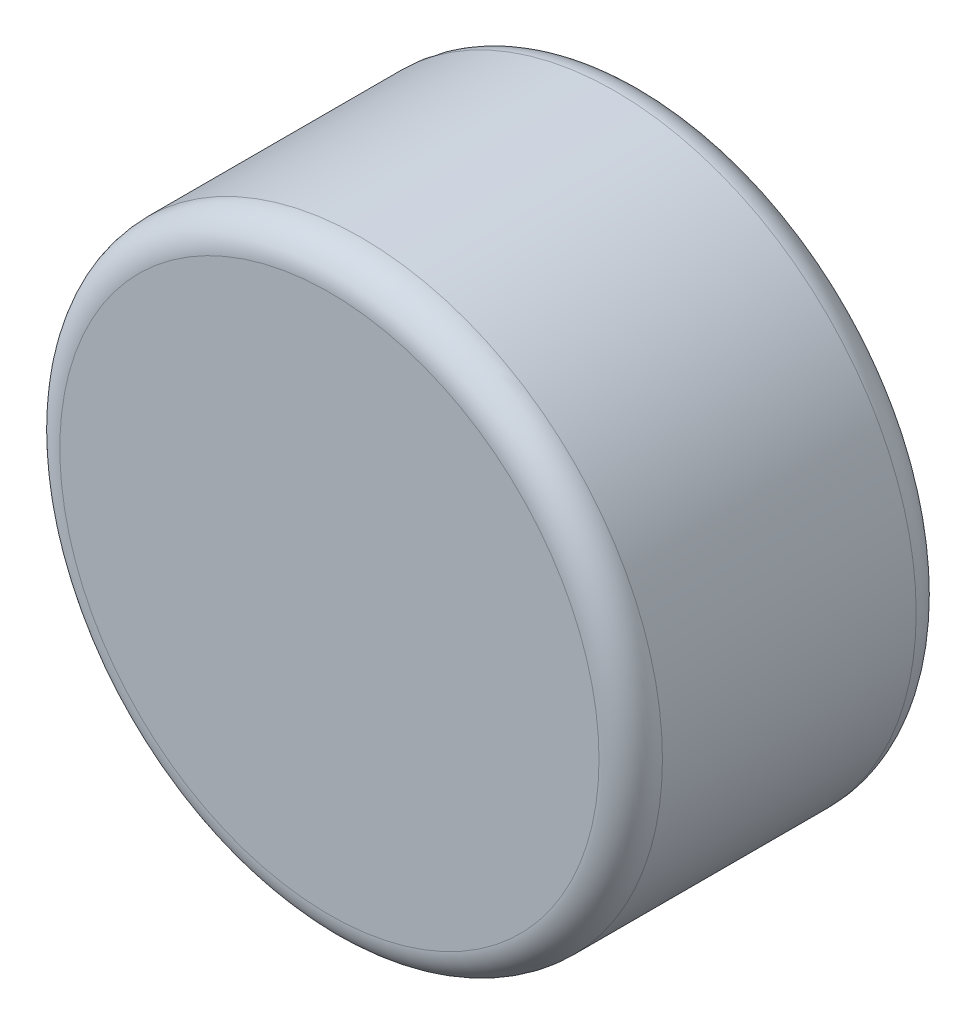
ISO-10303-21;
HEADER;
FILE_DESCRIPTION(('STEP AP214'),'2;1');
FILE_NAME('part.step','',(''),(''),'','','');
FILE_SCHEMA(('AUTOMOTIVE_DESIGN { 1 0 10303 214 1 1 1 1 }'));
ENDSEC;
DATA;
#1=APPLICATION_CONTEXT('core data for automotive mechanical design processes');
#2=APPLICATION_PROTOCOL_DEFINITION('international standard','automotive_design',2000,#1);
#3=PRODUCT_CONTEXT('',#1,'mechanical');
#4=PRODUCT('Part','Part','',(#3));
#5=PRODUCT_RELATED_PRODUCT_CATEGORY('part','',(#4));
#6=PRODUCT_DEFINITION_FORMATION('','',#4);
#7=PRODUCT_DEFINITION_CONTEXT('part definition',#1,'design');
#8=PRODUCT_DEFINITION('design','',#6,#7);
#9=PRODUCT_DEFINITION_SHAPE('','',#8);
#10=(LENGTH_UNIT() NAMED_UNIT(*) SI_UNIT(.MILLI.,.METRE.));
#11=(NAMED_UNIT(*) PLANE_ANGLE_UNIT() SI_UNIT($,.RADIAN.));
#12=(NAMED_UNIT(*) SI_UNIT($,.STERADIAN.) SOLID_ANGLE_UNIT());
#13=UNCERTAINTY_MEASURE_WITH_UNIT(LENGTH_MEASURE(1.E-05),#10,'distance_accuracy_value','');
#14=(GEOMETRIC_REPRESENTATION_CONTEXT(3) GLOBAL_UNCERTAINTY_ASSIGNED_CONTEXT((#13)) GLOBAL_UNIT_ASSIGNED_CONTEXT((#10,
#11,#12)) REPRESENTATION_CONTEXT('',''));
#15=CARTESIAN_POINT('',(0.,0.,0.));
#16=DIRECTION('',(0.,0.,1.));
#17=DIRECTION('',(1.,0.,0.));
#18=AXIS2_PLACEMENT_3D('',#15,#16,#17);
#19=CARTESIAN_POINT('',(0.,0.,50.));
#20=DIRECTION('',(0.,0.,-1.));
#21=DIRECTION('',(-1.,0.,0.));
#22=AXIS2_PLACEMENT_3D('',#19,#20,#21);
#23=CYLINDRICAL_SURFACE('',#22,47.5);
#24=CARTESIAN_POINT('',(0.,0.,5.));
#25=DIRECTION('',(0.,0.,1.));
#26=DIRECTION('',(1.,0.,0.));
#27=AXIS2_PLACEMENT_3D('',#24,#25,#26);
#28=CIRCLE('',#27,47.5);
#29=CARTESIAN_POINT('',(47.5,0.,5.));
#30=VERTEX_POINT('',#29);
#31=EDGE_CURVE('E43',#30,#30,#28,.T.);
#32=ORIENTED_EDGE('',*,*,#31,.T.);
#33=EDGE_LOOP('',(#32));
#34=FACE_BOUND('',#33,.T.);
#35=CARTESIAN_POINT('',(0.,0.,45.));
#36=DIRECTION('',(0.,0.,1.));
#37=DIRECTION('',(1.,0.,0.));
#38=AXIS2_PLACEMENT_3D('',#35,#36,#37);
#39=CIRCLE('',#38,47.5);
#40=CARTESIAN_POINT('',(47.5,0.,45.));
#41=VERTEX_POINT('',#40);
#42=EDGE_CURVE('E47',#41,#41,#39,.F.);
#43=ORIENTED_EDGE('',*,*,#42,.T.);
#44=EDGE_LOOP('',(#43));
#45=FACE_BOUND('',#44,.T.);
#46=ADVANCED_FACE('F32',(#34,#45),#23,.T.);
#47=CARTESIAN_POINT('',(0.,0.,50.));
#48=DIRECTION('',(0.,0.,1.));
#49=DIRECTION('',(1.,0.,0.));
#50=AXIS2_PLACEMENT_3D('',#47,#48,#49);
#51=PLANE('',#50);
#52=CARTESIAN_POINT('',(0.,0.,50.));
#53=DIRECTION('',(0.,0.,1.));
#54=DIRECTION('',(1.,0.,0.));
#55=AXIS2_PLACEMENT_3D('',#52,#53,#54);
#56=CIRCLE('',#55,42.5);
#57=CARTESIAN_POINT('',(42.5,0.,50.));
#58=VERTEX_POINT('',#57);
#59=EDGE_CURVE('E10',#58,#58,#56,.T.);
#60=ORIENTED_EDGE('',*,*,#59,.T.);
#61=EDGE_LOOP('',(#60));
#62=FACE_BOUND('',#61,.T.);
#63=ADVANCED_FACE('F63',(#62),#51,.T.);
#64=CARTESIAN_POINT('',(0.,0.,0.));
#65=DIRECTION('',(0.,0.,1.));
#66=DIRECTION('',(1.,0.,0.));
#67=AXIS2_PLACEMENT_3D('',#64,#65,#66);
#68=PLANE('',#67);
#69=CARTESIAN_POINT('',(0.,0.,0.));
#70=DIRECTION('',(0.,0.,1.));
#71=DIRECTION('',(1.,0.,0.));
#72=AXIS2_PLACEMENT_3D('',#69,#70,#71);
#73=CIRCLE('',#72,42.5);
#74=CARTESIAN_POINT('',(42.5,0.,0.));
#75=VERTEX_POINT('',#74);
#76=EDGE_CURVE('E39',#75,#75,#73,.F.);
#77=ORIENTED_EDGE('',*,*,#76,.T.);
#78=EDGE_LOOP('',(#77));
#79=FACE_BOUND('',#78,.T.);
#80=ADVANCED_FACE('F60',(#79),#68,.F.);
#81=CARTESIAN_POINT('',(0.,0.,5.));
#82=DIRECTION('',(0.,0.,1.));
#83=DIRECTION('',(1.,0.,0.));
#84=AXIS2_PLACEMENT_3D('',#81,#82,#83);
#85=TOROIDAL_SURFACE('',#84,42.5,5.);
#86=ORIENTED_EDGE('',*,*,#76,.F.);
#87=EDGE_LOOP('',(#86));
#88=FACE_BOUND('',#87,.T.);
#89=ORIENTED_EDGE('',*,*,#31,.F.);
#90=EDGE_LOOP('',(#89));
#91=FACE_BOUND('',#90,.T.);
#92=ADVANCED_FACE('F56',(#88,#91),#85,.T.);
#93=CARTESIAN_POINT('',(0.,0.,45.));
#94=DIRECTION('',(0.,0.,1.));
#95=DIRECTION('',(1.,0.,0.));
#96=AXIS2_PLACEMENT_3D('',#93,#94,#95);
#97=TOROIDAL_SURFACE('',#96,42.5,5.);
#98=ORIENTED_EDGE('',*,*,#42,.F.);
#99=EDGE_LOOP('',(#98));
#100=FACE_BOUND('',#99,.T.);
#101=ORIENTED_EDGE('',*,*,#59,.F.);
#102=EDGE_LOOP('',(#101));
#103=FACE_BOUND('',#102,.T.);
#104=ADVANCED_FACE('F34',(#100,#103),#97,.T.);
#105=CLOSED_SHELL('',(#46,#63,#80,#92,#104));
#106=MANIFOLD_SOLID_BREP('B2',#105);
#107=ADVANCED_BREP_SHAPE_REPRESENTATION('',(#18,#106),#14);
#108=SHAPE_DEFINITION_REPRESENTATION(#9,#107);
ENDSEC;
END-ISO-10303-21;
